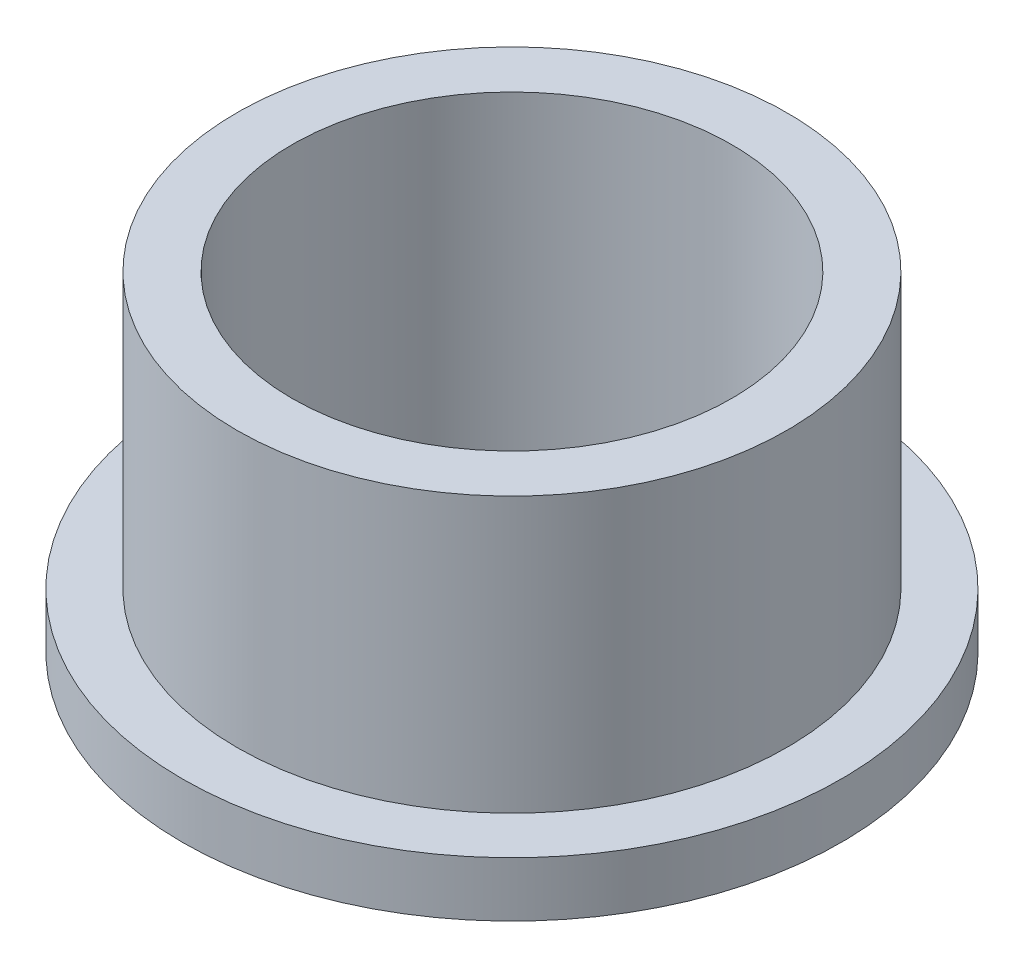
ISO-10303-21;
HEADER;
FILE_DESCRIPTION(('STEP AP214'),'2;1');
FILE_NAME('part.step','',(''),(''),'','','');
FILE_SCHEMA(('AUTOMOTIVE_DESIGN { 1 0 10303 214 1 1 1 1 }'));
ENDSEC;
DATA;
#1=APPLICATION_CONTEXT('core data for automotive mechanical design processes');
#2=APPLICATION_PROTOCOL_DEFINITION('international standard','automotive_design',2000,#1);
#3=PRODUCT_CONTEXT('',#1,'mechanical');
#4=PRODUCT('Part','Part','',(#3));
#5=PRODUCT_RELATED_PRODUCT_CATEGORY('part','',(#4));
#6=PRODUCT_DEFINITION_FORMATION('','',#4);
#7=PRODUCT_DEFINITION_CONTEXT('part definition',#1,'design');
#8=PRODUCT_DEFINITION('design','',#6,#7);
#9=PRODUCT_DEFINITION_SHAPE('','',#8);
#10=(LENGTH_UNIT() NAMED_UNIT(*) SI_UNIT(.MILLI.,.METRE.));
#11=(NAMED_UNIT(*) PLANE_ANGLE_UNIT() SI_UNIT($,.RADIAN.));
#12=(NAMED_UNIT(*) SI_UNIT($,.STERADIAN.) SOLID_ANGLE_UNIT());
#13=UNCERTAINTY_MEASURE_WITH_UNIT(LENGTH_MEASURE(1.E-05),#10,'distance_accuracy_value','');
#14=(GEOMETRIC_REPRESENTATION_CONTEXT(3) GLOBAL_UNCERTAINTY_ASSIGNED_CONTEXT((#13)) GLOBAL_UNIT_ASSIGNED_CONTEXT((#10,
#11,#12)) REPRESENTATION_CONTEXT('',''));
#15=CARTESIAN_POINT('',(0.,0.,0.));
#16=DIRECTION('',(0.,0.,1.));
#17=DIRECTION('',(1.,0.,0.));
#18=AXIS2_PLACEMENT_3D('',#15,#16,#17);
#19=CARTESIAN_POINT('',(0.,19.05,0.));
#20=DIRECTION('',(0.,1.,0.));
#21=DIRECTION('',(0.,0.,1.));
#22=AXIS2_PLACEMENT_3D('',#19,#20,#21);
#23=PLANE('',#22);
#24=CARTESIAN_POINT('',(0.,19.05,0.));
#25=DIRECTION('',(0.,1.,0.));
#26=DIRECTION('',(0.,0.,1.));
#27=AXIS2_PLACEMENT_3D('',#24,#25,#26);
#28=CIRCLE('',#27,15.9004);
#29=CARTESIAN_POINT('',(0.,19.05,15.9004));
#30=VERTEX_POINT('',#29);
#31=EDGE_CURVE('E10',#30,#30,#28,.T.);
#32=ORIENTED_EDGE('',*,*,#31,.T.);
#33=EDGE_LOOP('',(#32));
#34=FACE_BOUND('',#33,.T.);
#35=CARTESIAN_POINT('',(0.,19.05,0.));
#36=DIRECTION('',(0.,1.,0.));
#37=DIRECTION('',(0.,0.,1.));
#38=AXIS2_PLACEMENT_3D('',#35,#36,#37);
#39=CIRCLE('',#38,12.71016);
#40=CARTESIAN_POINT('',(0.,19.05,12.71016));
#41=VERTEX_POINT('',#40);
#42=EDGE_CURVE('E40',#41,#41,#39,.T.);
#43=ORIENTED_EDGE('',*,*,#42,.F.);
#44=EDGE_LOOP('',(#43));
#45=FACE_BOUND('',#44,.T.);
#46=ADVANCED_FACE('F33',(#34,#45),#23,.T.);
#47=CARTESIAN_POINT('',(0.,0.,0.));
#48=DIRECTION('',(0.,1.,0.));
#49=DIRECTION('',(0.,0.,1.));
#50=AXIS2_PLACEMENT_3D('',#47,#48,#49);
#51=PLANE('',#50);
#52=CARTESIAN_POINT('',(0.,0.,0.));
#53=DIRECTION('',(0.,1.,0.));
#54=DIRECTION('',(0.,0.,1.));
#55=AXIS2_PLACEMENT_3D('',#52,#53,#54);
#56=CIRCLE('',#55,12.71016);
#57=CARTESIAN_POINT('',(0.,0.,12.71016));
#58=VERTEX_POINT('',#57);
#59=EDGE_CURVE('E44',#58,#58,#56,.T.);
#60=ORIENTED_EDGE('',*,*,#59,.T.);
#61=EDGE_LOOP('',(#60));
#62=FACE_BOUND('',#61,.T.);
#63=CARTESIAN_POINT('',(0.,0.,0.));
#64=DIRECTION('',(0.,1.,0.));
#65=DIRECTION('',(0.,0.,1.));
#66=AXIS2_PLACEMENT_3D('',#63,#64,#65);
#67=CIRCLE('',#66,19.05);
#68=CARTESIAN_POINT('',(0.,0.,19.05));
#69=VERTEX_POINT('',#68);
#70=EDGE_CURVE('E51',#69,#69,#67,.T.);
#71=ORIENTED_EDGE('',*,*,#70,.F.);
#72=EDGE_LOOP('',(#71));
#73=FACE_BOUND('',#72,.T.);
#74=ADVANCED_FACE('F76',(#62,#73),#51,.F.);
#75=CARTESIAN_POINT('',(0.,19.05,0.));
#76=DIRECTION('',(0.,-1.,0.));
#77=DIRECTION('',(0.,0.,-1.));
#78=AXIS2_PLACEMENT_3D('',#75,#76,#77);
#79=CYLINDRICAL_SURFACE('',#78,15.9004);
#80=CARTESIAN_POINT('',(0.,3.175,0.));
#81=DIRECTION('',(0.,1.,0.));
#82=DIRECTION('',(0.,0.,1.));
#83=AXIS2_PLACEMENT_3D('',#80,#81,#82);
#84=CIRCLE('',#83,15.9004);
#85=CARTESIAN_POINT('',(0.,3.175,15.9004));
#86=VERTEX_POINT('',#85);
#87=EDGE_CURVE('E54',#86,#86,#84,.T.);
#88=ORIENTED_EDGE('',*,*,#87,.T.);
#89=EDGE_LOOP('',(#88));
#90=FACE_BOUND('',#89,.T.);
#91=ORIENTED_EDGE('',*,*,#31,.F.);
#92=EDGE_LOOP('',(#91));
#93=FACE_BOUND('',#92,.T.);
#94=ADVANCED_FACE('F35',(#90,#93),#79,.T.);
#95=CARTESIAN_POINT('',(0.,19.05,0.));
#96=DIRECTION('',(0.,-1.,0.));
#97=DIRECTION('',(0.,0.,-1.));
#98=AXIS2_PLACEMENT_3D('',#95,#96,#97);
#99=CYLINDRICAL_SURFACE('',#98,12.71016);
#100=ORIENTED_EDGE('',*,*,#42,.T.);
#101=EDGE_LOOP('',(#100));
#102=FACE_BOUND('',#101,.T.);
#103=ORIENTED_EDGE('',*,*,#59,.F.);
#104=EDGE_LOOP('',(#103));
#105=FACE_BOUND('',#104,.T.);
#106=ADVANCED_FACE('F65',(#102,#105),#99,.F.);
#107=CARTESIAN_POINT('',(0.,3.175,0.));
#108=DIRECTION('',(0.,1.,0.));
#109=DIRECTION('',(0.,0.,1.));
#110=AXIS2_PLACEMENT_3D('',#107,#108,#109);
#111=PLANE('',#110);
#112=CARTESIAN_POINT('',(0.,3.175,0.));
#113=DIRECTION('',(0.,1.,0.));
#114=DIRECTION('',(0.,0.,1.));
#115=AXIS2_PLACEMENT_3D('',#112,#113,#114);
#116=CIRCLE('',#115,19.05);
#117=CARTESIAN_POINT('',(0.,3.175,19.05));
#118=VERTEX_POINT('',#117);
#119=EDGE_CURVE('E49',#118,#118,#116,.T.);
#120=ORIENTED_EDGE('',*,*,#119,.T.);
#121=EDGE_LOOP('',(#120));
#122=FACE_BOUND('',#121,.T.);
#123=ORIENTED_EDGE('',*,*,#87,.F.);
#124=EDGE_LOOP('',(#123));
#125=FACE_BOUND('',#124,.T.);
#126=ADVANCED_FACE('F62',(#122,#125),#111,.T.);
#127=CARTESIAN_POINT('',(0.,3.175,0.));
#128=DIRECTION('',(0.,-1.,0.));
#129=DIRECTION('',(0.,0.,-1.));
#130=AXIS2_PLACEMENT_3D('',#127,#128,#129);
#131=CYLINDRICAL_SURFACE('',#130,19.05);
#132=ORIENTED_EDGE('',*,*,#119,.F.);
#133=EDGE_LOOP('',(#132));
#134=FACE_BOUND('',#133,.T.);
#135=ORIENTED_EDGE('',*,*,#70,.T.);
#136=EDGE_LOOP('',(#135));
#137=FACE_BOUND('',#136,.T.);
#138=ADVANCED_FACE('F64',(#134,#137),#131,.T.);
#139=CLOSED_SHELL('',(#46,#74,#94,#106,#126,#138));
#140=MANIFOLD_SOLID_BREP('B2',#139);
#141=ADVANCED_BREP_SHAPE_REPRESENTATION('',(#18,#140),#14);
#142=SHAPE_DEFINITION_REPRESENTATION(#9,#141);
ENDSEC;
END-ISO-10303-21;
